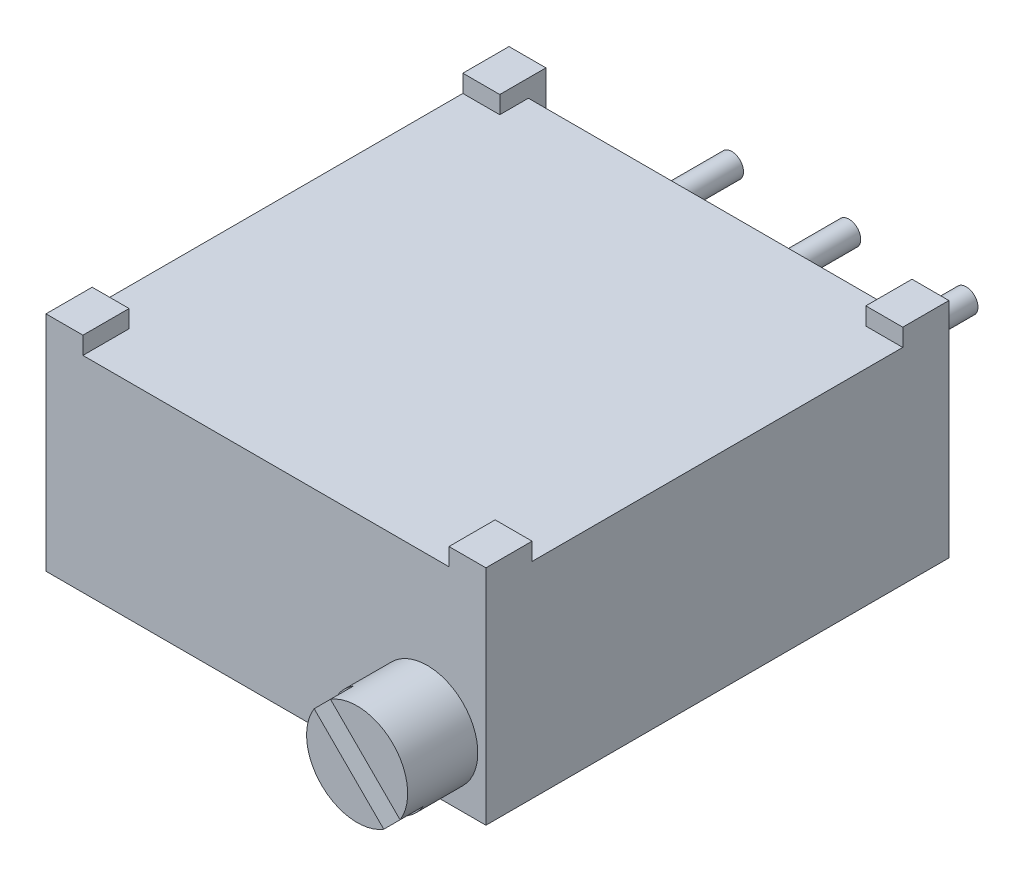
ISO-10303-21;
HEADER;
FILE_DESCRIPTION(('STEP AP214'),'2;1');
FILE_NAME('part.step','',(''),(''),'','','');
FILE_SCHEMA(('AUTOMOTIVE_DESIGN { 1 0 10303 214 1 1 1 1 }'));
ENDSEC;
DATA;
#1=APPLICATION_CONTEXT('core data for automotive mechanical design processes');
#2=APPLICATION_PROTOCOL_DEFINITION('international standard','automotive_design',2000,#1);
#3=PRODUCT_CONTEXT('',#1,'mechanical');
#4=PRODUCT('Part','Part','',(#3));
#5=PRODUCT_RELATED_PRODUCT_CATEGORY('part','',(#4));
#6=PRODUCT_DEFINITION_FORMATION('','',#4);
#7=PRODUCT_DEFINITION_CONTEXT('part definition',#1,'design');
#8=PRODUCT_DEFINITION('design','',#6,#7);
#9=PRODUCT_DEFINITION_SHAPE('','',#8);
#10=(LENGTH_UNIT() NAMED_UNIT(*) SI_UNIT(.MILLI.,.METRE.));
#11=(NAMED_UNIT(*) PLANE_ANGLE_UNIT() SI_UNIT($,.RADIAN.));
#12=(NAMED_UNIT(*) SI_UNIT($,.STERADIAN.) SOLID_ANGLE_UNIT());
#13=UNCERTAINTY_MEASURE_WITH_UNIT(LENGTH_MEASURE(1.E-05),#10,'distance_accuracy_value','');
#14=(GEOMETRIC_REPRESENTATION_CONTEXT(3) GLOBAL_UNCERTAINTY_ASSIGNED_CONTEXT((#13)) GLOBAL_UNIT_ASSIGNED_CONTEXT((#10,
#11,#12)) REPRESENTATION_CONTEXT('',''));
#15=CARTESIAN_POINT('',(0.,0.,0.));
#16=DIRECTION('',(0.,0.,1.));
#17=DIRECTION('',(1.,0.,0.));
#18=AXIS2_PLACEMENT_3D('',#15,#16,#17);
#19=CARTESIAN_POINT('',(-3.965,2.416,0.38));
#20=DIRECTION('',(0.,0.,1.));
#21=DIRECTION('',(1.,0.,0.));
#22=AXIS2_PLACEMENT_3D('',#19,#20,#21);
#23=PLANE('',#22);
#24=CARTESIAN_POINT('',(2.54,0.00499999999999949,0.380000000000001));
#25=DIRECTION('',(0.,0.,1.));
#26=DIRECTION('',(1.,0.,0.));
#27=AXIS2_PLACEMENT_3D('',#24,#25,#26);
#28=CIRCLE('',#27,0.255);
#29=CARTESIAN_POINT('',(2.795,0.00499999999999949,0.380000000000001));
#30=VERTEX_POINT('',#29);
#31=EDGE_CURVE('E41',#30,#30,#28,.F.);
#32=ORIENTED_EDGE('',*,*,#31,.F.);
#33=EDGE_LOOP('',(#32));
#34=FACE_BOUND('',#33,.T.);
#35=DIRECTION('',(-1.,0.,0.));
#36=VECTOR('',#35,1.);
#37=CARTESIAN_POINT('',(3.965,2.035,0.380000000000001));
#38=LINE('',#37,#36);
#39=CARTESIAN_POINT('',(3.965,2.035,0.380000000000001));
#40=VERTEX_POINT('',#39);
#41=CARTESIAN_POINT('',(-3.965,2.035,0.38));
#42=VERTEX_POINT('',#41);
#43=EDGE_CURVE('E217',#40,#42,#38,.T.);
#44=ORIENTED_EDGE('',*,*,#43,.F.);
#45=DIRECTION('',(0.,-1.,0.));
#46=VECTOR('',#45,1.);
#47=CARTESIAN_POINT('',(3.965,2.416,0.380000000000001));
#48=LINE('',#47,#46);
#49=CARTESIAN_POINT('',(3.965,-2.415,0.380000000000001));
#50=VERTEX_POINT('',#49);
#51=EDGE_CURVE('E301',#40,#50,#48,.T.);
#52=ORIENTED_EDGE('',*,*,#51,.T.);
#53=DIRECTION('',(-1.,0.,0.));
#54=VECTOR('',#53,1.);
#55=CARTESIAN_POINT('',(-3.965,-2.415,0.38));
#56=LINE('',#55,#54);
#57=CARTESIAN_POINT('',(-3.965,-2.415,0.38));
#58=VERTEX_POINT('',#57);
#59=EDGE_CURVE('E298',#50,#58,#56,.T.);
#60=ORIENTED_EDGE('',*,*,#59,.T.);
#61=DIRECTION('',(0.,-1.,0.));
#62=VECTOR('',#61,1.);
#63=CARTESIAN_POINT('',(-3.965,2.416,0.38));
#64=LINE('',#63,#62);
#65=EDGE_CURVE('E302',#42,#58,#64,.T.);
#66=ORIENTED_EDGE('',*,*,#65,.F.);
#67=EDGE_LOOP('',(#44,#52,#60,#66));
#68=FACE_BOUND('',#67,.T.);
#69=CARTESIAN_POINT('',(0.,0.0049999999999998,0.380000000000001));
#70=DIRECTION('',(0.,0.,1.));
#71=DIRECTION('',(1.,0.,0.));
#72=AXIS2_PLACEMENT_3D('',#69,#70,#71);
#73=CIRCLE('',#72,0.255);
#74=CARTESIAN_POINT('',(0.255,0.0049999999999998,0.380000000000001));
#75=VERTEX_POINT('',#74);
#76=EDGE_CURVE('E349',#75,#75,#73,.F.);
#77=ORIENTED_EDGE('',*,*,#76,.F.);
#78=EDGE_LOOP('',(#77));
#79=FACE_BOUND('',#78,.T.);
#80=CARTESIAN_POINT('',(-2.54,0.0049999999999998,0.38));
#81=DIRECTION('',(0.,0.,1.));
#82=DIRECTION('',(1.,0.,0.));
#83=AXIS2_PLACEMENT_3D('',#80,#81,#82);
#84=CIRCLE('',#83,0.255);
#85=CARTESIAN_POINT('',(-2.285,0.0049999999999998,0.38));
#86=VERTEX_POINT('',#85);
#87=EDGE_CURVE('E11',#86,#86,#84,.F.);
#88=ORIENTED_EDGE('',*,*,#87,.F.);
#89=EDGE_LOOP('',(#88));
#90=FACE_BOUND('',#89,.T.);
#91=ADVANCED_FACE('F33',(#34,#68,#79,#90),#23,.F.);
#92=CARTESIAN_POINT('',(3.495,-1.145,11.55));
#93=DIRECTION('',(0.,0.,1.));
#94=DIRECTION('',(1.,0.,0.));
#95=AXIS2_PLACEMENT_3D('',#92,#93,#94);
#96=PLANE('',#95);
#97=DIRECTION('',(-0.707106781186546,0.707106781186548,0.));
#98=VECTOR('',#97,1.);
#99=CARTESIAN_POINT('',(2.91794481748833,-0.214391426895054,11.55));
#100=LINE('',#99,#98);
#101=CARTESIAN_POINT('',(4.42560857310494,-1.72205518251167,11.55));
#102=VERTEX_POINT('',#101);
#103=CARTESIAN_POINT('',(2.91794481748833,-0.214391426895054,11.55));
#104=VERTEX_POINT('',#103);
#105=EDGE_CURVE('E198',#102,#104,#100,.T.);
#106=ORIENTED_EDGE('',*,*,#105,.F.);
#107=CARTESIAN_POINT('',(3.495,-1.145,11.55));
#108=DIRECTION('',(0.,0.,1.));
#109=DIRECTION('',(1.,0.,0.));
#110=AXIS2_PLACEMENT_3D('',#107,#108,#109);
#111=CIRCLE('',#110,1.095);
#112=EDGE_CURVE('E211',#102,#104,#111,.T.);
#113=ORIENTED_EDGE('',*,*,#112,.T.);
#114=EDGE_LOOP('',(#106,#113));
#115=FACE_BOUND('',#114,.T.);
#116=ADVANCED_FACE('F358',(#115),#96,.T.);
#117=CARTESIAN_POINT('',(-4.765,2.415,10.03));
#118=DIRECTION('',(0.,0.,-1.));
#119=DIRECTION('',(-1.,0.,0.));
#120=AXIS2_PLACEMENT_3D('',#117,#118,#119);
#121=PLANE('',#120);
#122=DIRECTION('',(1.,0.,0.));
#123=VECTOR('',#122,1.);
#124=CARTESIAN_POINT('',(-4.765,2.415,10.03));
#125=LINE('',#124,#123);
#126=CARTESIAN_POINT('',(3.965,2.415,10.03));
#127=VERTEX_POINT('',#126);
#128=CARTESIAN_POINT('',(4.765,2.415,10.03));
#129=VERTEX_POINT('',#128);
#130=EDGE_CURVE('E311',#127,#129,#125,.T.);
#131=ORIENTED_EDGE('',*,*,#130,.F.);
#132=DIRECTION('',(0.,1.,0.));
#133=VECTOR('',#132,1.);
#134=CARTESIAN_POINT('',(3.965,2.035,10.03));
#135=LINE('',#134,#133);
#136=CARTESIAN_POINT('',(3.965,2.035,10.03));
#137=VERTEX_POINT('',#136);
#138=EDGE_CURVE('E275',#137,#127,#135,.T.);
#139=ORIENTED_EDGE('',*,*,#138,.F.);
#140=DIRECTION('',(1.,0.,0.));
#141=VECTOR('',#140,1.);
#142=CARTESIAN_POINT('',(-3.965,2.035,10.03));
#143=LINE('',#142,#141);
#144=CARTESIAN_POINT('',(-3.965,2.035,10.03));
#145=VERTEX_POINT('',#144);
#146=EDGE_CURVE('E236',#145,#137,#143,.T.);
#147=ORIENTED_EDGE('',*,*,#146,.F.);
#148=DIRECTION('',(0.,1.,0.));
#149=VECTOR('',#148,1.);
#150=CARTESIAN_POINT('',(-3.965,2.035,10.03));
#151=LINE('',#150,#149);
#152=CARTESIAN_POINT('',(-3.965,2.415,10.03));
#153=VERTEX_POINT('',#152);
#154=EDGE_CURVE('E277',#145,#153,#151,.T.);
#155=ORIENTED_EDGE('',*,*,#154,.T.);
#156=CARTESIAN_POINT('',(-4.765,2.415,10.03));
#157=VERTEX_POINT('',#156);
#158=EDGE_CURVE('E313',#157,#153,#125,.T.);
#159=ORIENTED_EDGE('',*,*,#158,.F.);
#160=DIRECTION('',(0.,-1.,0.));
#161=VECTOR('',#160,1.);
#162=CARTESIAN_POINT('',(-4.765,2.415,10.03));
#163=LINE('',#162,#161);
#164=CARTESIAN_POINT('',(-4.765,-2.415,10.03));
#165=VERTEX_POINT('',#164);
#166=EDGE_CURVE('E343',#157,#165,#163,.T.);
#167=ORIENTED_EDGE('',*,*,#166,.T.);
#168=DIRECTION('',(1.,0.,0.));
#169=VECTOR('',#168,1.);
#170=CARTESIAN_POINT('',(-4.765,-2.415,10.03));
#171=LINE('',#170,#169);
#172=CARTESIAN_POINT('',(4.765,-2.415,10.03));
#173=VERTEX_POINT('',#172);
#174=EDGE_CURVE('E327',#165,#173,#171,.T.);
#175=ORIENTED_EDGE('',*,*,#174,.T.);
#176=DIRECTION('',(0.,-1.,0.));
#177=VECTOR('',#176,1.);
#178=CARTESIAN_POINT('',(4.765,2.415,10.03));
#179=LINE('',#178,#177);
#180=EDGE_CURVE('E340',#129,#173,#179,.T.);
#181=ORIENTED_EDGE('',*,*,#180,.F.);
#182=EDGE_LOOP('',(#131,#139,#147,#155,#159,#167,#175,#181));
#183=FACE_BOUND('',#182,.T.);
#184=CARTESIAN_POINT('',(3.495,-1.145,10.03));
#185=DIRECTION('',(0.,0.,-1.));
#186=DIRECTION('',(-1.,0.,0.));
#187=AXIS2_PLACEMENT_3D('',#184,#185,#186);
#188=CIRCLE('',#187,1.095);
#189=CARTESIAN_POINT('',(2.4,-1.145,10.03));
#190=VERTEX_POINT('',#189);
#191=EDGE_CURVE('E346',#190,#190,#188,.F.);
#192=ORIENTED_EDGE('',*,*,#191,.F.);
#193=EDGE_LOOP('',(#192));
#194=FACE_BOUND('',#193,.T.);
#195=ADVANCED_FACE('F462',(#183,#194),#121,.F.);
#196=CARTESIAN_POINT('',(0.,2.415,0.));
#197=DIRECTION('',(0.,-1.,0.));
#198=DIRECTION('',(0.,0.,-1.));
#199=AXIS2_PLACEMENT_3D('',#196,#197,#198);
#200=PLANE('',#199);
#201=DIRECTION('',(0.,0.,-1.));
#202=VECTOR('',#201,1.);
#203=CARTESIAN_POINT('',(3.965,2.415,-0.619999999999999));
#204=LINE('',#203,#202);
#205=CARTESIAN_POINT('',(3.965,2.415,1.));
#206=VERTEX_POINT('',#205);
#207=CARTESIAN_POINT('',(3.965,2.415,0.));
#208=VERTEX_POINT('',#207);
#209=EDGE_CURVE('E304',#206,#208,#204,.T.);
#210=ORIENTED_EDGE('',*,*,#209,.F.);
#211=DIRECTION('',(-1.,0.,0.));
#212=VECTOR('',#211,1.);
#213=CARTESIAN_POINT('',(4.765,2.415,0.999999999999999));
#214=LINE('',#213,#212);
#215=CARTESIAN_POINT('',(4.765,2.415,0.999999999999999));
#216=VERTEX_POINT('',#215);
#217=EDGE_CURVE('E218',#216,#206,#214,.T.);
#218=ORIENTED_EDGE('',*,*,#217,.F.);
#219=DIRECTION('',(0.,0.,-1.));
#220=VECTOR('',#219,1.);
#221=CARTESIAN_POINT('',(4.765,2.415,10.03));
#222=LINE('',#221,#220);
#223=CARTESIAN_POINT('',(4.765,2.415,0.));
#224=VERTEX_POINT('',#223);
#225=EDGE_CURVE('E316',#216,#224,#222,.T.);
#226=ORIENTED_EDGE('',*,*,#225,.T.);
#227=DIRECTION('',(-1.,0.,0.));
#228=VECTOR('',#227,1.);
#229=CARTESIAN_POINT('',(-4.765,2.415,0.));
#230=LINE('',#229,#228);
#231=EDGE_CURVE('E321',#224,#208,#230,.T.);
#232=ORIENTED_EDGE('',*,*,#231,.T.);
#233=EDGE_LOOP('',(#210,#218,#226,#232));
#234=FACE_BOUND('',#233,.T.);
#235=ADVANCED_FACE('F450',(#234),#200,.F.);
#236=CARTESIAN_POINT('',(4.765,2.415,9.03));
#237=VERTEX_POINT('',#236);
#238=EDGE_CURVE('E317',#129,#237,#222,.T.);
#239=ORIENTED_EDGE('',*,*,#238,.T.);
#240=DIRECTION('',(1.,0.,0.));
#241=VECTOR('',#240,1.);
#242=CARTESIAN_POINT('',(3.965,2.415,9.03));
#243=LINE('',#242,#241);
#244=CARTESIAN_POINT('',(3.965,2.415,9.03));
#245=VERTEX_POINT('',#244);
#246=EDGE_CURVE('E261',#245,#237,#243,.T.);
#247=ORIENTED_EDGE('',*,*,#246,.F.);
#248=DIRECTION('',(0.,0.,-1.));
#249=VECTOR('',#248,1.);
#250=CARTESIAN_POINT('',(3.965,2.415,10.03));
#251=LINE('',#250,#249);
#252=EDGE_CURVE('E258',#127,#245,#251,.T.);
#253=ORIENTED_EDGE('',*,*,#252,.F.);
#254=ORIENTED_EDGE('',*,*,#130,.T.);
#255=EDGE_LOOP('',(#239,#247,#253,#254));
#256=FACE_BOUND('',#255,.T.);
#257=ADVANCED_FACE('F469',(#256),#200,.F.);
#258=ORIENTED_EDGE('',*,*,#158,.T.);
#259=DIRECTION('',(0.,0.,1.));
#260=VECTOR('',#259,1.);
#261=CARTESIAN_POINT('',(-3.965,2.415,9.03));
#262=LINE('',#261,#260);
#263=CARTESIAN_POINT('',(-3.965,2.415,9.03));
#264=VERTEX_POINT('',#263);
#265=EDGE_CURVE('E256',#264,#153,#262,.T.);
#266=ORIENTED_EDGE('',*,*,#265,.F.);
#267=DIRECTION('',(1.,0.,0.));
#268=VECTOR('',#267,1.);
#269=CARTESIAN_POINT('',(-4.765,2.415,9.03));
#270=LINE('',#269,#268);
#271=CARTESIAN_POINT('',(-4.765,2.415,9.03));
#272=VERTEX_POINT('',#271);
#273=EDGE_CURVE('E253',#272,#264,#270,.T.);
#274=ORIENTED_EDGE('',*,*,#273,.F.);
#275=DIRECTION('',(0.,0.,1.));
#276=VECTOR('',#275,1.);
#277=CARTESIAN_POINT('',(-4.765,2.415,10.03));
#278=LINE('',#277,#276);
#279=EDGE_CURVE('E312',#272,#157,#278,.T.);
#280=ORIENTED_EDGE('',*,*,#279,.T.);
#281=EDGE_LOOP('',(#258,#266,#274,#280));
#282=FACE_BOUND('',#281,.T.);
#283=ADVANCED_FACE('F451',(#282),#200,.F.);
#284=CARTESIAN_POINT('',(-4.765,2.415,0.));
#285=DIRECTION('',(0.,0.,1.));
#286=DIRECTION('',(1.,0.,0.));
#287=AXIS2_PLACEMENT_3D('',#284,#285,#286);
#288=PLANE('',#287);
#289=CARTESIAN_POINT('',(-3.965,2.415,0.));
#290=VERTEX_POINT('',#289);
#291=CARTESIAN_POINT('',(-4.765,2.415,0.));
#292=VERTEX_POINT('',#291);
#293=EDGE_CURVE('E320',#290,#292,#230,.T.);
#294=ORIENTED_EDGE('',*,*,#293,.F.);
#295=DIRECTION('',(0.,1.,0.));
#296=VECTOR('',#295,1.);
#297=CARTESIAN_POINT('',(-3.965,2.416,0.));
#298=LINE('',#297,#296);
#299=CARTESIAN_POINT('',(-3.965,-2.415,0.));
#300=VERTEX_POINT('',#299);
#301=EDGE_CURVE('E290',#300,#290,#298,.T.);
#302=ORIENTED_EDGE('',*,*,#301,.F.);
#303=DIRECTION('',(-1.,0.,0.));
#304=VECTOR('',#303,1.);
#305=CARTESIAN_POINT('',(-4.765,-2.415,0.));
#306=LINE('',#305,#304);
#307=CARTESIAN_POINT('',(-4.765,-2.415,0.));
#308=VERTEX_POINT('',#307);
#309=EDGE_CURVE('E331',#300,#308,#306,.T.);
#310=ORIENTED_EDGE('',*,*,#309,.T.);
#311=DIRECTION('',(0.,-1.,0.));
#312=VECTOR('',#311,1.);
#313=CARTESIAN_POINT('',(-4.765,2.415,0.));
#314=LINE('',#313,#312);
#315=EDGE_CURVE('E324',#292,#308,#314,.T.);
#316=ORIENTED_EDGE('',*,*,#315,.F.);
#317=EDGE_LOOP('',(#294,#302,#310,#316));
#318=FACE_BOUND('',#317,.T.);
#319=ADVANCED_FACE('F459',(#318),#288,.F.);
#320=CARTESIAN_POINT('',(-4.765,2.415,10.03));
#321=DIRECTION('',(1.,0.,0.));
#322=DIRECTION('',(0.,0.,-1.));
#323=AXIS2_PLACEMENT_3D('',#320,#321,#322);
#324=PLANE('',#323);
#325=ORIENTED_EDGE('',*,*,#279,.F.);
#326=DIRECTION('',(0.,1.,0.));
#327=VECTOR('',#326,1.);
#328=CARTESIAN_POINT('',(-4.765,2.035,9.03));
#329=LINE('',#328,#327);
#330=CARTESIAN_POINT('',(-4.765,2.035,9.03));
#331=VERTEX_POINT('',#330);
#332=EDGE_CURVE('E282',#331,#272,#329,.T.);
#333=ORIENTED_EDGE('',*,*,#332,.F.);
#334=DIRECTION('',(0.,0.,1.));
#335=VECTOR('',#334,1.);
#336=CARTESIAN_POINT('',(-4.765,2.035,1.));
#337=LINE('',#336,#335);
#338=CARTESIAN_POINT('',(-4.765,2.035,1.));
#339=VERTEX_POINT('',#338);
#340=EDGE_CURVE('E227',#339,#331,#337,.T.);
#341=ORIENTED_EDGE('',*,*,#340,.F.);
#342=DIRECTION('',(0.,1.,0.));
#343=VECTOR('',#342,1.);
#344=CARTESIAN_POINT('',(-4.765,2.035,1.));
#345=LINE('',#344,#343);
#346=CARTESIAN_POINT('',(-4.765,2.415,1.));
#347=VERTEX_POINT('',#346);
#348=EDGE_CURVE('E284',#339,#347,#345,.T.);
#349=ORIENTED_EDGE('',*,*,#348,.T.);
#350=EDGE_CURVE('E308',#292,#347,#278,.T.);
#351=ORIENTED_EDGE('',*,*,#350,.F.);
#352=ORIENTED_EDGE('',*,*,#315,.T.);
#353=DIRECTION('',(0.,0.,1.));
#354=VECTOR('',#353,1.);
#355=CARTESIAN_POINT('',(-4.765,-2.415,10.03));
#356=LINE('',#355,#354);
#357=EDGE_CURVE('E307',#308,#165,#356,.T.);
#358=ORIENTED_EDGE('',*,*,#357,.T.);
#359=ORIENTED_EDGE('',*,*,#166,.F.);
#360=EDGE_LOOP('',(#325,#333,#341,#349,#351,#352,#358,#359));
#361=FACE_BOUND('',#360,.T.);
#362=ADVANCED_FACE('F35',(#361),#324,.F.);
#363=CARTESIAN_POINT('',(4.765,2.415,10.03));
#364=DIRECTION('',(-1.,0.,0.));
#365=DIRECTION('',(0.,0.,1.));
#366=AXIS2_PLACEMENT_3D('',#363,#364,#365);
#367=PLANE('',#366);
#368=ORIENTED_EDGE('',*,*,#225,.F.);
#369=DIRECTION('',(0.,1.,0.));
#370=VECTOR('',#369,1.);
#371=CARTESIAN_POINT('',(4.765,2.035,0.999999999999999));
#372=LINE('',#371,#370);
#373=CARTESIAN_POINT('',(4.765,2.035,0.999999999999999));
#374=VERTEX_POINT('',#373);
#375=EDGE_CURVE('E268',#374,#216,#372,.T.);
#376=ORIENTED_EDGE('',*,*,#375,.F.);
#377=DIRECTION('',(0.,0.,-1.));
#378=VECTOR('',#377,1.);
#379=CARTESIAN_POINT('',(4.765,2.035,9.03));
#380=LINE('',#379,#378);
#381=CARTESIAN_POINT('',(4.765,2.035,9.03));
#382=VERTEX_POINT('',#381);
#383=EDGE_CURVE('E245',#382,#374,#380,.T.);
#384=ORIENTED_EDGE('',*,*,#383,.F.);
#385=DIRECTION('',(0.,1.,0.));
#386=VECTOR('',#385,1.);
#387=CARTESIAN_POINT('',(4.765,2.035,9.03));
#388=LINE('',#387,#386);
#389=EDGE_CURVE('E270',#382,#237,#388,.T.);
#390=ORIENTED_EDGE('',*,*,#389,.T.);
#391=ORIENTED_EDGE('',*,*,#238,.F.);
#392=ORIENTED_EDGE('',*,*,#180,.T.);
#393=DIRECTION('',(0.,0.,-1.));
#394=VECTOR('',#393,1.);
#395=CARTESIAN_POINT('',(4.765,-2.415,10.03));
#396=LINE('',#395,#394);
#397=CARTESIAN_POINT('',(4.765,-2.415,0.));
#398=VERTEX_POINT('',#397);
#399=EDGE_CURVE('E329',#173,#398,#396,.T.);
#400=ORIENTED_EDGE('',*,*,#399,.T.);
#401=DIRECTION('',(0.,-1.,0.));
#402=VECTOR('',#401,1.);
#403=CARTESIAN_POINT('',(4.765,2.415,0.));
#404=LINE('',#403,#402);
#405=EDGE_CURVE('E337',#224,#398,#404,.T.);
#406=ORIENTED_EDGE('',*,*,#405,.F.);
#407=EDGE_LOOP('',(#368,#376,#384,#390,#391,#392,#400,#406));
#408=FACE_BOUND('',#407,.T.);
#409=ADVANCED_FACE('F457',(#408),#367,.F.);
#410=CARTESIAN_POINT('',(3.965,-2.415,0.));
#411=VERTEX_POINT('',#410);
#412=EDGE_CURVE('E332',#398,#411,#306,.T.);
#413=ORIENTED_EDGE('',*,*,#412,.T.);
#414=DIRECTION('',(0.,-1.,0.));
#415=VECTOR('',#414,1.);
#416=CARTESIAN_POINT('',(3.965,2.416,0.));
#417=LINE('',#416,#415);
#418=EDGE_CURVE('E56',#208,#411,#417,.T.);
#419=ORIENTED_EDGE('',*,*,#418,.F.);
#420=ORIENTED_EDGE('',*,*,#231,.F.);
#421=ORIENTED_EDGE('',*,*,#405,.T.);
#422=EDGE_LOOP('',(#413,#419,#420,#421));
#423=FACE_BOUND('',#422,.T.);
#424=ADVANCED_FACE('F448',(#423),#288,.F.);
#425=ORIENTED_EDGE('',*,*,#350,.T.);
#426=DIRECTION('',(-1.,0.,0.));
#427=VECTOR('',#426,1.);
#428=CARTESIAN_POINT('',(-3.965,2.415,1.));
#429=LINE('',#428,#427);
#430=CARTESIAN_POINT('',(-3.965,2.415,1.));
#431=VERTEX_POINT('',#430);
#432=EDGE_CURVE('E251',#431,#347,#429,.T.);
#433=ORIENTED_EDGE('',*,*,#432,.F.);
#434=DIRECTION('',(0.,0.,1.));
#435=VECTOR('',#434,1.);
#436=CARTESIAN_POINT('',(-3.965,2.415,-0.62));
#437=LINE('',#436,#435);
#438=EDGE_CURVE('E292',#290,#431,#437,.T.);
#439=ORIENTED_EDGE('',*,*,#438,.F.);
#440=ORIENTED_EDGE('',*,*,#293,.T.);
#441=EDGE_LOOP('',(#425,#433,#439,#440));
#442=FACE_BOUND('',#441,.T.);
#443=ADVANCED_FACE('F445',(#442),#200,.F.);
#444=CARTESIAN_POINT('',(0.,-2.415,0.));
#445=DIRECTION('',(0.,-1.,0.));
#446=DIRECTION('',(0.,0.,-1.));
#447=AXIS2_PLACEMENT_3D('',#444,#445,#446);
#448=PLANE('',#447);
#449=DIRECTION('',(0.,0.,-1.));
#450=VECTOR('',#449,1.);
#451=CARTESIAN_POINT('',(-3.965,-2.415,-0.62));
#452=LINE('',#451,#450);
#453=EDGE_CURVE('E294',#58,#300,#452,.T.);
#454=ORIENTED_EDGE('',*,*,#453,.F.);
#455=ORIENTED_EDGE('',*,*,#59,.F.);
#456=DIRECTION('',(0.,0.,1.));
#457=VECTOR('',#456,1.);
#458=CARTESIAN_POINT('',(3.965,-2.415,-0.619999999999999));
#459=LINE('',#458,#457);
#460=EDGE_CURVE('E296',#411,#50,#459,.T.);
#461=ORIENTED_EDGE('',*,*,#460,.F.);
#462=ORIENTED_EDGE('',*,*,#412,.F.);
#463=ORIENTED_EDGE('',*,*,#399,.F.);
#464=ORIENTED_EDGE('',*,*,#174,.F.);
#465=ORIENTED_EDGE('',*,*,#357,.F.);
#466=ORIENTED_EDGE('',*,*,#309,.F.);
#467=EDGE_LOOP('',(#454,#455,#461,#462,#463,#464,#465,#466));
#468=FACE_BOUND('',#467,.T.);
#469=ADVANCED_FACE('F443',(#468),#448,.T.);
#470=CARTESIAN_POINT('',(-3.965,2.416,-0.62));
#471=DIRECTION('',(-1.,0.,0.));
#472=DIRECTION('',(0.,0.,1.));
#473=AXIS2_PLACEMENT_3D('',#470,#471,#472);
#474=PLANE('',#473);
#475=ORIENTED_EDGE('',*,*,#301,.T.);
#476=ORIENTED_EDGE('',*,*,#438,.T.);
#477=DIRECTION('',(0.,1.,0.));
#478=VECTOR('',#477,1.);
#479=CARTESIAN_POINT('',(-3.965,2.035,1.));
#480=LINE('',#479,#478);
#481=CARTESIAN_POINT('',(-3.965,2.035,1.));
#482=VERTEX_POINT('',#481);
#483=EDGE_CURVE('E250',#482,#431,#480,.T.);
#484=ORIENTED_EDGE('',*,*,#483,.F.);
#485=DIRECTION('',(0.,0.,1.));
#486=VECTOR('',#485,1.);
#487=CARTESIAN_POINT('',(-3.965,2.035,0.38));
#488=LINE('',#487,#486);
#489=EDGE_CURVE('E221',#42,#482,#488,.T.);
#490=ORIENTED_EDGE('',*,*,#489,.F.);
#491=ORIENTED_EDGE('',*,*,#65,.T.);
#492=ORIENTED_EDGE('',*,*,#453,.T.);
#493=EDGE_LOOP('',(#475,#476,#484,#490,#491,#492));
#494=FACE_BOUND('',#493,.T.);
#495=ADVANCED_FACE('F440',(#494),#474,.F.);
#496=CARTESIAN_POINT('',(3.965,2.416,-0.619999999999999));
#497=DIRECTION('',(1.,0.,0.));
#498=DIRECTION('',(0.,0.,-1.));
#499=AXIS2_PLACEMENT_3D('',#496,#497,#498);
#500=PLANE('',#499);
#501=ORIENTED_EDGE('',*,*,#418,.T.);
#502=ORIENTED_EDGE('',*,*,#460,.T.);
#503=ORIENTED_EDGE('',*,*,#51,.F.);
#504=DIRECTION('',(0.,0.,-1.));
#505=VECTOR('',#504,1.);
#506=CARTESIAN_POINT('',(3.965,2.035,1.));
#507=LINE('',#506,#505);
#508=CARTESIAN_POINT('',(3.965,2.035,1.));
#509=VERTEX_POINT('',#508);
#510=EDGE_CURVE('E215',#509,#40,#507,.T.);
#511=ORIENTED_EDGE('',*,*,#510,.F.);
#512=DIRECTION('',(0.,1.,0.));
#513=VECTOR('',#512,1.);
#514=CARTESIAN_POINT('',(3.965,2.035,1.));
#515=LINE('',#514,#513);
#516=EDGE_CURVE('E265',#509,#206,#515,.T.);
#517=ORIENTED_EDGE('',*,*,#516,.T.);
#518=ORIENTED_EDGE('',*,*,#209,.T.);
#519=EDGE_LOOP('',(#501,#502,#503,#511,#517,#518));
#520=FACE_BOUND('',#519,.T.);
#521=ADVANCED_FACE('F418',(#520),#500,.F.);
#522=CARTESIAN_POINT('',(4.765,2.035,0.999999999999999));
#523=DIRECTION('',(0.,0.,-1.));
#524=DIRECTION('',(-1.,0.,0.));
#525=AXIS2_PLACEMENT_3D('',#522,#523,#524);
#526=PLANE('',#525);
#527=ORIENTED_EDGE('',*,*,#217,.T.);
#528=ORIENTED_EDGE('',*,*,#516,.F.);
#529=DIRECTION('',(-1.,0.,0.));
#530=VECTOR('',#529,1.);
#531=CARTESIAN_POINT('',(4.765,2.035,0.999999999999999));
#532=LINE('',#531,#530);
#533=EDGE_CURVE('E247',#374,#509,#532,.T.);
#534=ORIENTED_EDGE('',*,*,#533,.F.);
#535=ORIENTED_EDGE('',*,*,#375,.T.);
#536=EDGE_LOOP('',(#527,#528,#534,#535));
#537=FACE_BOUND('',#536,.T.);
#538=ADVANCED_FACE('F414',(#537),#526,.F.);
#539=CARTESIAN_POINT('',(3.965,2.035,9.03));
#540=DIRECTION('',(0.,0.,1.));
#541=DIRECTION('',(1.,0.,0.));
#542=AXIS2_PLACEMENT_3D('',#539,#540,#541);
#543=PLANE('',#542);
#544=ORIENTED_EDGE('',*,*,#246,.T.);
#545=ORIENTED_EDGE('',*,*,#389,.F.);
#546=DIRECTION('',(1.,0.,0.));
#547=VECTOR('',#546,1.);
#548=CARTESIAN_POINT('',(3.965,2.035,9.03));
#549=LINE('',#548,#547);
#550=CARTESIAN_POINT('',(3.965,2.035,9.03));
#551=VERTEX_POINT('',#550);
#552=EDGE_CURVE('E242',#551,#382,#549,.T.);
#553=ORIENTED_EDGE('',*,*,#552,.F.);
#554=DIRECTION('',(0.,1.,0.));
#555=VECTOR('',#554,1.);
#556=CARTESIAN_POINT('',(3.965,2.035,9.03));
#557=LINE('',#556,#555);
#558=EDGE_CURVE('E273',#551,#245,#557,.T.);
#559=ORIENTED_EDGE('',*,*,#558,.T.);
#560=EDGE_LOOP('',(#544,#545,#553,#559));
#561=FACE_BOUND('',#560,.T.);
#562=ADVANCED_FACE('F417',(#561),#543,.F.);
#563=CARTESIAN_POINT('',(3.965,2.035,10.03));
#564=DIRECTION('',(1.,0.,0.));
#565=DIRECTION('',(0.,0.,-1.));
#566=AXIS2_PLACEMENT_3D('',#563,#564,#565);
#567=PLANE('',#566);
#568=ORIENTED_EDGE('',*,*,#252,.T.);
#569=ORIENTED_EDGE('',*,*,#558,.F.);
#570=DIRECTION('',(0.,0.,-1.));
#571=VECTOR('',#570,1.);
#572=CARTESIAN_POINT('',(3.965,2.035,10.03));
#573=LINE('',#572,#571);
#574=EDGE_CURVE('E239',#137,#551,#573,.T.);
#575=ORIENTED_EDGE('',*,*,#574,.F.);
#576=ORIENTED_EDGE('',*,*,#138,.T.);
#577=EDGE_LOOP('',(#568,#569,#575,#576));
#578=FACE_BOUND('',#577,.T.);
#579=ADVANCED_FACE('F422',(#578),#567,.F.);
#580=CARTESIAN_POINT('',(-3.965,2.035,9.03));
#581=DIRECTION('',(-1.,0.,0.));
#582=DIRECTION('',(0.,0.,1.));
#583=AXIS2_PLACEMENT_3D('',#580,#581,#582);
#584=PLANE('',#583);
#585=ORIENTED_EDGE('',*,*,#265,.T.);
#586=ORIENTED_EDGE('',*,*,#154,.F.);
#587=DIRECTION('',(0.,0.,1.));
#588=VECTOR('',#587,1.);
#589=CARTESIAN_POINT('',(-3.965,2.035,9.03));
#590=LINE('',#589,#588);
#591=CARTESIAN_POINT('',(-3.965,2.035,9.03));
#592=VERTEX_POINT('',#591);
#593=EDGE_CURVE('E233',#592,#145,#590,.T.);
#594=ORIENTED_EDGE('',*,*,#593,.F.);
#595=DIRECTION('',(0.,1.,0.));
#596=VECTOR('',#595,1.);
#597=CARTESIAN_POINT('',(-3.965,2.035,9.03));
#598=LINE('',#597,#596);
#599=EDGE_CURVE('E280',#592,#264,#598,.T.);
#600=ORIENTED_EDGE('',*,*,#599,.T.);
#601=EDGE_LOOP('',(#585,#586,#594,#600));
#602=FACE_BOUND('',#601,.T.);
#603=ADVANCED_FACE('F426',(#602),#584,.F.);
#604=CARTESIAN_POINT('',(-4.765,2.035,9.03));
#605=DIRECTION('',(0.,0.,1.));
#606=DIRECTION('',(1.,0.,0.));
#607=AXIS2_PLACEMENT_3D('',#604,#605,#606);
#608=PLANE('',#607);
#609=ORIENTED_EDGE('',*,*,#273,.T.);
#610=ORIENTED_EDGE('',*,*,#599,.F.);
#611=DIRECTION('',(1.,0.,0.));
#612=VECTOR('',#611,1.);
#613=CARTESIAN_POINT('',(-4.765,2.035,9.03));
#614=LINE('',#613,#612);
#615=EDGE_CURVE('E230',#331,#592,#614,.T.);
#616=ORIENTED_EDGE('',*,*,#615,.F.);
#617=ORIENTED_EDGE('',*,*,#332,.T.);
#618=EDGE_LOOP('',(#609,#610,#616,#617));
#619=FACE_BOUND('',#618,.T.);
#620=ADVANCED_FACE('F430',(#619),#608,.F.);
#621=CARTESIAN_POINT('',(-3.965,2.035,1.));
#622=DIRECTION('',(0.,0.,-1.));
#623=DIRECTION('',(-1.,0.,0.));
#624=AXIS2_PLACEMENT_3D('',#621,#622,#623);
#625=PLANE('',#624);
#626=ORIENTED_EDGE('',*,*,#432,.T.);
#627=ORIENTED_EDGE('',*,*,#348,.F.);
#628=DIRECTION('',(-1.,0.,0.));
#629=VECTOR('',#628,1.);
#630=CARTESIAN_POINT('',(-3.965,2.035,1.));
#631=LINE('',#630,#629);
#632=EDGE_CURVE('E224',#482,#339,#631,.T.);
#633=ORIENTED_EDGE('',*,*,#632,.F.);
#634=ORIENTED_EDGE('',*,*,#483,.T.);
#635=EDGE_LOOP('',(#626,#627,#633,#634));
#636=FACE_BOUND('',#635,.T.);
#637=ADVANCED_FACE('F412',(#636),#625,.F.);
#638=CARTESIAN_POINT('',(0.,2.035,0.));
#639=DIRECTION('',(0.,1.,0.));
#640=DIRECTION('',(0.,0.,1.));
#641=AXIS2_PLACEMENT_3D('',#638,#639,#640);
#642=PLANE('',#641);
#643=ORIENTED_EDGE('',*,*,#510,.T.);
#644=ORIENTED_EDGE('',*,*,#43,.T.);
#645=ORIENTED_EDGE('',*,*,#489,.T.);
#646=ORIENTED_EDGE('',*,*,#632,.T.);
#647=ORIENTED_EDGE('',*,*,#340,.T.);
#648=ORIENTED_EDGE('',*,*,#615,.T.);
#649=ORIENTED_EDGE('',*,*,#593,.T.);
#650=ORIENTED_EDGE('',*,*,#146,.T.);
#651=ORIENTED_EDGE('',*,*,#574,.T.);
#652=ORIENTED_EDGE('',*,*,#552,.T.);
#653=ORIENTED_EDGE('',*,*,#383,.T.);
#654=ORIENTED_EDGE('',*,*,#533,.T.);
#655=EDGE_LOOP('',(#643,#644,#645,#646,#647,#648,#649,#650,#651,#652,#653,#654));
#656=FACE_BOUND('',#655,.T.);
#657=ADVANCED_FACE('F409',(#656),#642,.T.);
#658=CARTESIAN_POINT('',(3.495,-1.145,11.55));
#659=DIRECTION('',(0.,0.,-1.));
#660=DIRECTION('',(-1.,0.,0.));
#661=AXIS2_PLACEMENT_3D('',#658,#659,#660);
#662=CYLINDRICAL_SURFACE('',#661,1.095);
#663=CARTESIAN_POINT('',(3.495,-1.145,11.05));
#664=DIRECTION('',(0.,0.,1.));
#665=DIRECTION('',(1.,0.,0.));
#666=AXIS2_PLACEMENT_3D('',#663,#664,#665);
#667=CIRCLE('',#666,1.095);
#668=CARTESIAN_POINT('',(2.91794481748833,-0.214391426895054,11.05));
#669=VERTEX_POINT('',#668);
#670=CARTESIAN_POINT('',(2.56439142689505,-0.567944817488327,11.05));
#671=VERTEX_POINT('',#670);
#672=EDGE_CURVE('E189',#669,#671,#667,.T.);
#673=ORIENTED_EDGE('',*,*,#672,.F.);
#674=DIRECTION('',(0.,0.,1.));
#675=VECTOR('',#674,1.);
#676=CARTESIAN_POINT('',(2.91794481748833,-0.214391426895054,11.05));
#677=LINE('',#676,#675);
#678=EDGE_CURVE('E214',#669,#104,#677,.T.);
#679=ORIENTED_EDGE('',*,*,#678,.T.);
#680=ORIENTED_EDGE('',*,*,#112,.F.);
#681=DIRECTION('',(0.,0.,1.));
#682=VECTOR('',#681,1.);
#683=CARTESIAN_POINT('',(4.42560857310494,-1.72205518251167,11.05));
#684=LINE('',#683,#682);
#685=CARTESIAN_POINT('',(4.42560857310494,-1.72205518251167,11.05));
#686=VERTEX_POINT('',#685);
#687=EDGE_CURVE('E206',#686,#102,#684,.T.);
#688=ORIENTED_EDGE('',*,*,#687,.F.);
#689=CARTESIAN_POINT('',(3.495,-1.145,11.05));
#690=DIRECTION('',(0.,0.,1.));
#691=DIRECTION('',(1.,0.,0.));
#692=AXIS2_PLACEMENT_3D('',#689,#690,#691);
#693=CIRCLE('',#692,1.095);
#694=CARTESIAN_POINT('',(4.07205518251167,-2.07560857310495,11.05));
#695=VERTEX_POINT('',#694);
#696=EDGE_CURVE('E188',#695,#686,#693,.T.);
#697=ORIENTED_EDGE('',*,*,#696,.F.);
#698=DIRECTION('',(0.,0.,1.));
#699=VECTOR('',#698,1.);
#700=CARTESIAN_POINT('',(4.07205518251167,-2.07560857310495,11.05));
#701=LINE('',#700,#699);
#702=CARTESIAN_POINT('',(4.07205518251167,-2.07560857310495,11.55));
#703=VERTEX_POINT('',#702);
#704=EDGE_CURVE('E185',#695,#703,#701,.T.);
#705=ORIENTED_EDGE('',*,*,#704,.T.);
#706=CARTESIAN_POINT('',(2.56439142689505,-0.567944817488327,11.55));
#707=VERTEX_POINT('',#706);
#708=EDGE_CURVE('E204',#707,#703,#111,.T.);
#709=ORIENTED_EDGE('',*,*,#708,.F.);
#710=DIRECTION('',(0.,0.,1.));
#711=VECTOR('',#710,1.);
#712=CARTESIAN_POINT('',(2.56439142689505,-0.567944817488327,11.05));
#713=LINE('',#712,#711);
#714=EDGE_CURVE('E48',#671,#707,#713,.T.);
#715=ORIENTED_EDGE('',*,*,#714,.F.);
#716=EDGE_LOOP('',(#673,#679,#680,#688,#697,#705,#709,#715));
#717=FACE_BOUND('',#716,.T.);
#718=ORIENTED_EDGE('',*,*,#191,.T.);
#719=EDGE_LOOP('',(#718));
#720=FACE_BOUND('',#719,.T.);
#721=ADVANCED_FACE('F201',(#717,#720),#662,.T.);
#722=DIRECTION('',(0.707106781186546,-0.707106781186548,0.));
#723=VECTOR('',#722,1.);
#724=CARTESIAN_POINT('',(2.56439142689505,-0.567944817488327,11.55));
#725=LINE('',#724,#723);
#726=EDGE_CURVE('E715',#707,#703,#725,.T.);
#727=ORIENTED_EDGE('',*,*,#726,.F.);
#728=ORIENTED_EDGE('',*,*,#708,.T.);
#729=EDGE_LOOP('',(#727,#728));
#730=FACE_BOUND('',#729,.T.);
#731=ADVANCED_FACE('F400',(#730),#96,.T.);
#732=CARTESIAN_POINT('',(2.91794481748833,-0.214391426895054,11.05));
#733=DIRECTION('',(0.707106781186549,0.707106781186547,0.));
#734=DIRECTION('',(-0.707106781186546,0.707106781186549,0.));
#735=AXIS2_PLACEMENT_3D('',#732,#733,#734);
#736=PLANE('',#735);
#737=ORIENTED_EDGE('',*,*,#105,.T.);
#738=ORIENTED_EDGE('',*,*,#678,.F.);
#739=DIRECTION('',(-0.707106781186546,0.707106781186548,0.));
#740=VECTOR('',#739,1.);
#741=CARTESIAN_POINT('',(2.91794481748833,-0.214391426895054,11.05));
#742=LINE('',#741,#740);
#743=EDGE_CURVE('E195',#686,#669,#742,.T.);
#744=ORIENTED_EDGE('',*,*,#743,.F.);
#745=ORIENTED_EDGE('',*,*,#687,.T.);
#746=EDGE_LOOP('',(#737,#738,#744,#745));
#747=FACE_BOUND('',#746,.T.);
#748=ADVANCED_FACE('F397',(#747),#736,.F.);
#749=CARTESIAN_POINT('',(2.56439142689505,-0.567944817488327,11.05));
#750=DIRECTION('',(-0.707106781186549,-0.707106781186547,0.));
#751=DIRECTION('',(0.707106781186546,-0.707106781186549,0.));
#752=AXIS2_PLACEMENT_3D('',#749,#750,#751);
#753=PLANE('',#752);
#754=ORIENTED_EDGE('',*,*,#726,.T.);
#755=ORIENTED_EDGE('',*,*,#704,.F.);
#756=DIRECTION('',(0.707106781186546,-0.707106781186548,0.));
#757=VECTOR('',#756,1.);
#758=CARTESIAN_POINT('',(2.56439142689505,-0.567944817488327,11.05));
#759=LINE('',#758,#757);
#760=EDGE_CURVE('E181',#671,#695,#759,.T.);
#761=ORIENTED_EDGE('',*,*,#760,.F.);
#762=ORIENTED_EDGE('',*,*,#714,.T.);
#763=EDGE_LOOP('',(#754,#755,#761,#762));
#764=FACE_BOUND('',#763,.T.);
#765=ADVANCED_FACE('F183',(#764),#753,.F.);
#766=CARTESIAN_POINT('',(3.495,-1.145,11.05));
#767=DIRECTION('',(0.,0.,1.));
#768=DIRECTION('',(1.,0.,0.));
#769=AXIS2_PLACEMENT_3D('',#766,#767,#768);
#770=PLANE('',#769);
#771=ORIENTED_EDGE('',*,*,#672,.T.);
#772=ORIENTED_EDGE('',*,*,#760,.T.);
#773=ORIENTED_EDGE('',*,*,#696,.T.);
#774=ORIENTED_EDGE('',*,*,#743,.T.);
#775=EDGE_LOOP('',(#771,#772,#773,#774));
#776=FACE_BOUND('',#775,.T.);
#777=ADVANCED_FACE('F193',(#776),#770,.T.);
#778=CARTESIAN_POINT('',(0.,0.0049999999999998,-2.6));
#779=DIRECTION('',(0.,0.,1.));
#780=DIRECTION('',(1.,0.,0.));
#781=AXIS2_PLACEMENT_3D('',#778,#779,#780);
#782=CYLINDRICAL_SURFACE('',#781,0.255);
#783=CARTESIAN_POINT('',(0.,0.0049999999999998,-2.6));
#784=DIRECTION('',(0.,0.,-1.));
#785=DIRECTION('',(-1.,0.,0.));
#786=AXIS2_PLACEMENT_3D('',#783,#784,#785);
#787=CIRCLE('',#786,0.255);
#788=CARTESIAN_POINT('',(-0.255,0.0049999999999998,-2.6));
#789=VERTEX_POINT('',#788);
#790=EDGE_CURVE('E720',#789,#789,#787,.T.);
#791=ORIENTED_EDGE('',*,*,#790,.F.);
#792=EDGE_LOOP('',(#791));
#793=FACE_BOUND('',#792,.T.);
#794=ORIENTED_EDGE('',*,*,#76,.T.);
#795=EDGE_LOOP('',(#794));
#796=FACE_BOUND('',#795,.T.);
#797=ADVANCED_FACE('F390',(#793,#796),#782,.T.);
#798=CARTESIAN_POINT('',(0.,0.0049999999999998,-2.6));
#799=DIRECTION('',(0.,0.,-1.));
#800=DIRECTION('',(-1.,0.,0.));
#801=AXIS2_PLACEMENT_3D('',#798,#799,#800);
#802=PLANE('',#801);
#803=ORIENTED_EDGE('',*,*,#790,.T.);
#804=EDGE_LOOP('',(#803));
#805=FACE_BOUND('',#804,.T.);
#806=ADVANCED_FACE('F386',(#805),#802,.T.);
#807=CARTESIAN_POINT('',(2.54,0.00499999999999949,-2.6));
#808=DIRECTION('',(0.,0.,1.));
#809=DIRECTION('',(1.,0.,0.));
#810=AXIS2_PLACEMENT_3D('',#807,#808,#809);
#811=CYLINDRICAL_SURFACE('',#810,0.255);
#812=CARTESIAN_POINT('',(2.54,0.00499999999999949,-2.6));
#813=DIRECTION('',(0.,0.,-1.));
#814=DIRECTION('',(-1.,0.,0.));
#815=AXIS2_PLACEMENT_3D('',#812,#813,#814);
#816=CIRCLE('',#815,0.255);
#817=CARTESIAN_POINT('',(2.285,0.00499999999999949,-2.6));
#818=VERTEX_POINT('',#817);
#819=EDGE_CURVE('E725',#818,#818,#816,.T.);
#820=ORIENTED_EDGE('',*,*,#819,.F.);
#821=EDGE_LOOP('',(#820));
#822=FACE_BOUND('',#821,.T.);
#823=ORIENTED_EDGE('',*,*,#31,.T.);
#824=EDGE_LOOP('',(#823));
#825=FACE_BOUND('',#824,.T.);
#826=ADVANCED_FACE('F354',(#822,#825),#811,.T.);
#827=CARTESIAN_POINT('',(2.54,0.00499999999999949,-2.6));
#828=DIRECTION('',(0.,0.,-1.));
#829=DIRECTION('',(-1.,0.,0.));
#830=AXIS2_PLACEMENT_3D('',#827,#828,#829);
#831=PLANE('',#830);
#832=ORIENTED_EDGE('',*,*,#819,.T.);
#833=EDGE_LOOP('',(#832));
#834=FACE_BOUND('',#833,.T.);
#835=ADVANCED_FACE('F371',(#834),#831,.T.);
#836=CARTESIAN_POINT('',(-2.54,0.0049999999999998,-2.6));
#837=DIRECTION('',(0.,0.,1.));
#838=DIRECTION('',(1.,0.,0.));
#839=AXIS2_PLACEMENT_3D('',#836,#837,#838);
#840=CYLINDRICAL_SURFACE('',#839,0.255);
#841=CARTESIAN_POINT('',(-2.54,0.0049999999999998,-2.6));
#842=DIRECTION('',(0.,0.,-1.));
#843=DIRECTION('',(-1.,0.,0.));
#844=AXIS2_PLACEMENT_3D('',#841,#842,#843);
#845=CIRCLE('',#844,0.255);
#846=CARTESIAN_POINT('',(-2.795,0.0049999999999998,-2.6));
#847=VERTEX_POINT('',#846);
#848=EDGE_CURVE('E728',#847,#847,#845,.T.);
#849=ORIENTED_EDGE('',*,*,#848,.F.);
#850=EDGE_LOOP('',(#849));
#851=FACE_BOUND('',#850,.T.);
#852=ORIENTED_EDGE('',*,*,#87,.T.);
#853=EDGE_LOOP('',(#852));
#854=FACE_BOUND('',#853,.T.);
#855=ADVANCED_FACE('F368',(#851,#854),#840,.T.);
#856=CARTESIAN_POINT('',(-2.54,0.0049999999999998,-2.6));
#857=DIRECTION('',(0.,0.,-1.));
#858=DIRECTION('',(-1.,0.,0.));
#859=AXIS2_PLACEMENT_3D('',#856,#857,#858);
#860=PLANE('',#859);
#861=ORIENTED_EDGE('',*,*,#848,.T.);
#862=EDGE_LOOP('',(#861));
#863=FACE_BOUND('',#862,.T.);
#864=ADVANCED_FACE('F370',(#863),#860,.T.);
#865=CLOSED_SHELL('',(#91,#116,#195,#235,#257,#283,#319,#362,#409,#424,#443,#469,#495,#521,#538,
#562,#579,#603,#620,#637,#657,#721,#731,#748,#765,#777,#797,#806,#826,#835,#855,#864));
#866=MANIFOLD_SOLID_BREP('B2',#865);
#867=ADVANCED_BREP_SHAPE_REPRESENTATION('',(#18,#866),#14);
#868=SHAPE_DEFINITION_REPRESENTATION(#9,#867);
ENDSEC;
END-ISO-10303-21;
